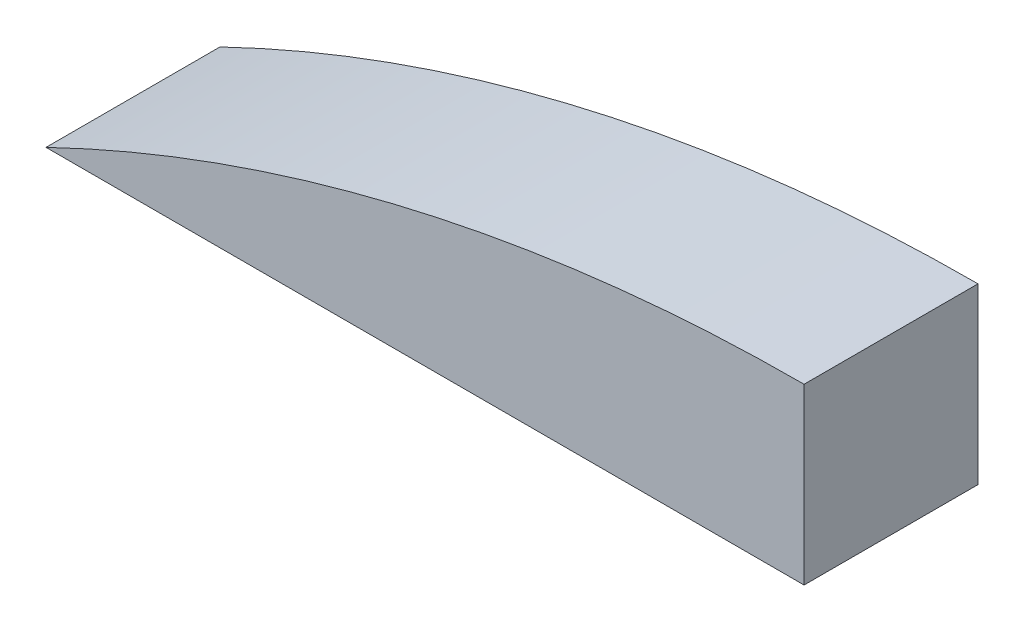
ISO-10303-21;
HEADER;
FILE_DESCRIPTION(('STEP AP214'),'2;1');
FILE_NAME('part.step','',(''),(''),'','','');
FILE_SCHEMA(('AUTOMOTIVE_DESIGN { 1 0 10303 214 1 1 1 1 }'));
ENDSEC;
DATA;
#1=APPLICATION_CONTEXT('core data for automotive mechanical design processes');
#2=APPLICATION_PROTOCOL_DEFINITION('international standard','automotive_design',2000,#1);
#3=PRODUCT_CONTEXT('',#1,'mechanical');
#4=PRODUCT('Part','Part','',(#3));
#5=PRODUCT_RELATED_PRODUCT_CATEGORY('part','',(#4));
#6=PRODUCT_DEFINITION_FORMATION('','',#4);
#7=PRODUCT_DEFINITION_CONTEXT('part definition',#1,'design');
#8=PRODUCT_DEFINITION('design','',#6,#7);
#9=PRODUCT_DEFINITION_SHAPE('','',#8);
#10=(LENGTH_UNIT() NAMED_UNIT(*) SI_UNIT(.MILLI.,.METRE.));
#11=(NAMED_UNIT(*) PLANE_ANGLE_UNIT() SI_UNIT($,.RADIAN.));
#12=(NAMED_UNIT(*) SI_UNIT($,.STERADIAN.) SOLID_ANGLE_UNIT());
#13=UNCERTAINTY_MEASURE_WITH_UNIT(LENGTH_MEASURE(1.E-05),#10,'distance_accuracy_value','');
#14=(GEOMETRIC_REPRESENTATION_CONTEXT(3) GLOBAL_UNCERTAINTY_ASSIGNED_CONTEXT((#13)) GLOBAL_UNIT_ASSIGNED_CONTEXT((#10,
#11,#12)) REPRESENTATION_CONTEXT('',''));
#15=CARTESIAN_POINT('',(0.,0.,0.));
#16=DIRECTION('',(0.,0.,1.));
#17=DIRECTION('',(1.,0.,0.));
#18=AXIS2_PLACEMENT_3D('',#15,#16,#17);
#19=CARTESIAN_POINT('',(-502.733741957931,0.,0.));
#20=DIRECTION('',(1.,0.,0.));
#21=DIRECTION('',(0.,0.,-1.));
#22=AXIS2_PLACEMENT_3D('',#19,#20,#21);
#23=PLANE('',#22);
#24=DIRECTION('',(0.,0.,1.));
#25=VECTOR('',#24,1.);
#26=CARTESIAN_POINT('',(-502.733741957931,45.,0.));
#27=LINE('',#26,#25);
#28=CARTESIAN_POINT('',(-502.733741957931,45.,0.));
#29=VERTEX_POINT('',#28);
#30=CARTESIAN_POINT('',(-502.733741957931,45.,5.));
#31=VERTEX_POINT('',#30);
#32=EDGE_CURVE('E70',#29,#31,#27,.T.);
#33=ORIENTED_EDGE('',*,*,#32,.F.);
#34=DIRECTION('',(0.,1.,0.));
#35=VECTOR('',#34,1.);
#36=CARTESIAN_POINT('',(-502.733741957931,0.,0.));
#37=LINE('',#36,#35);
#38=CARTESIAN_POINT('',(-502.733741957931,50.,0.));
#39=VERTEX_POINT('',#38);
#40=EDGE_CURVE('E75',#29,#39,#37,.T.);
#41=ORIENTED_EDGE('',*,*,#40,.T.);
#42=DIRECTION('',(0.,0.,-1.));
#43=VECTOR('',#42,1.);
#44=CARTESIAN_POINT('',(-502.733741957931,50.,80.));
#45=LINE('',#44,#43);
#46=CARTESIAN_POINT('',(-502.733741957931,50.,5.));
#47=VERTEX_POINT('',#46);
#48=EDGE_CURVE('E87',#47,#39,#45,.T.);
#49=ORIENTED_EDGE('',*,*,#48,.F.);
#50=DIRECTION('',(0.,1.,0.));
#51=VECTOR('',#50,1.);
#52=CARTESIAN_POINT('',(-502.733741957931,-45.,5.));
#53=LINE('',#52,#51);
#54=EDGE_CURVE('E77',#31,#47,#53,.T.);
#55=ORIENTED_EDGE('',*,*,#54,.F.);
#56=EDGE_LOOP('',(#33,#41,#49,#55));
#57=FACE_BOUND('',#56,.T.);
#58=ADVANCED_FACE('F34',(#57),#23,.T.);
#59=CARTESIAN_POINT('',(-502.733741957931,0.,0.));
#60=DIRECTION('',(0.,0.,1.));
#61=DIRECTION('',(1.,0.,0.));
#62=AXIS2_PLACEMENT_3D('',#59,#60,#61);
#63=PLANE('',#62);
#64=ORIENTED_EDGE('',*,*,#40,.F.);
#65=DIRECTION('',(1.,0.,0.));
#66=VECTOR('',#65,1.);
#67=CARTESIAN_POINT('',(-502.733741957931,45.,0.));
#68=LINE('',#67,#66);
#69=CARTESIAN_POINT('',(-524.528236675635,45.,0.));
#70=VERTEX_POINT('',#69);
#71=EDGE_CURVE('E38',#70,#29,#68,.T.);
#72=ORIENTED_EDGE('',*,*,#71,.F.);
#73=CARTESIAN_POINT('',(-502.733741957931,0.,0.));
#74=DIRECTION('',(0.,0.,1.));
#75=DIRECTION('',(1.,0.,0.));
#76=AXIS2_PLACEMENT_3D('',#73,#74,#75);
#77=CIRCLE('',#76,50.);
#78=EDGE_CURVE('E50',#39,#70,#77,.T.);
#79=ORIENTED_EDGE('',*,*,#78,.F.);
#80=EDGE_LOOP('',(#64,#72,#79));
#81=FACE_BOUND('',#80,.T.);
#82=ADVANCED_FACE('F79',(#81),#63,.F.);
#83=CARTESIAN_POINT('',(-502.733741957931,0.,80.));
#84=DIRECTION('',(0.,0.,-1.));
#85=DIRECTION('',(-1.,0.,0.));
#86=AXIS2_PLACEMENT_3D('',#83,#84,#85);
#87=CYLINDRICAL_SURFACE('',#86,50.);
#88=DIRECTION('',(0.,0.,-1.));
#89=VECTOR('',#88,1.);
#90=CARTESIAN_POINT('',(-524.528236675635,45.,80.));
#91=LINE('',#90,#89);
#92=CARTESIAN_POINT('',(-524.528236675635,45.,5.));
#93=VERTEX_POINT('',#92);
#94=EDGE_CURVE('E11',#93,#70,#91,.T.);
#95=ORIENTED_EDGE('',*,*,#94,.F.);
#96=CARTESIAN_POINT('',(-502.733741957931,0.,5.));
#97=DIRECTION('',(0.,0.,1.));
#98=DIRECTION('',(1.,0.,0.));
#99=AXIS2_PLACEMENT_3D('',#96,#97,#98);
#100=CIRCLE('',#99,50.);
#101=EDGE_CURVE('E82',#47,#93,#100,.T.);
#102=ORIENTED_EDGE('',*,*,#101,.F.);
#103=ORIENTED_EDGE('',*,*,#48,.T.);
#104=ORIENTED_EDGE('',*,*,#78,.T.);
#105=EDGE_LOOP('',(#95,#102,#103,#104));
#106=FACE_BOUND('',#105,.T.);
#107=ADVANCED_FACE('F90',(#106),#87,.T.);
#108=CARTESIAN_POINT('',(0.,45.,0.));
#109=DIRECTION('',(0.,-1.,0.));
#110=DIRECTION('',(0.,0.,-1.));
#111=AXIS2_PLACEMENT_3D('',#108,#109,#110);
#112=PLANE('',#111);
#113=ORIENTED_EDGE('',*,*,#71,.T.);
#114=ORIENTED_EDGE('',*,*,#32,.T.);
#115=DIRECTION('',(1.,0.,0.));
#116=VECTOR('',#115,1.);
#117=CARTESIAN_POINT('',(597.266258042068,45.,5.));
#118=LINE('',#117,#116);
#119=EDGE_CURVE('E57',#93,#31,#118,.T.);
#120=ORIENTED_EDGE('',*,*,#119,.F.);
#121=ORIENTED_EDGE('',*,*,#94,.T.);
#122=EDGE_LOOP('',(#113,#114,#120,#121));
#123=FACE_BOUND('',#122,.T.);
#124=ADVANCED_FACE('F69',(#123),#112,.T.);
#125=CARTESIAN_POINT('',(597.266258042068,-45.,5.));
#126=DIRECTION('',(0.,0.,1.));
#127=DIRECTION('',(1.,0.,0.));
#128=AXIS2_PLACEMENT_3D('',#125,#126,#127);
#129=PLANE('',#128);
#130=ORIENTED_EDGE('',*,*,#119,.T.);
#131=ORIENTED_EDGE('',*,*,#54,.T.);
#132=ORIENTED_EDGE('',*,*,#101,.T.);
#133=EDGE_LOOP('',(#130,#131,#132));
#134=FACE_BOUND('',#133,.T.);
#135=ADVANCED_FACE('F36',(#134),#129,.T.);
#136=CLOSED_SHELL('',(#58,#82,#107,#124,#135));
#137=MANIFOLD_SOLID_BREP('B2',#136);
#138=ADVANCED_BREP_SHAPE_REPRESENTATION('',(#18,#137),#14);
#139=SHAPE_DEFINITION_REPRESENTATION(#9,#138);
ENDSEC;
END-ISO-10303-21;
